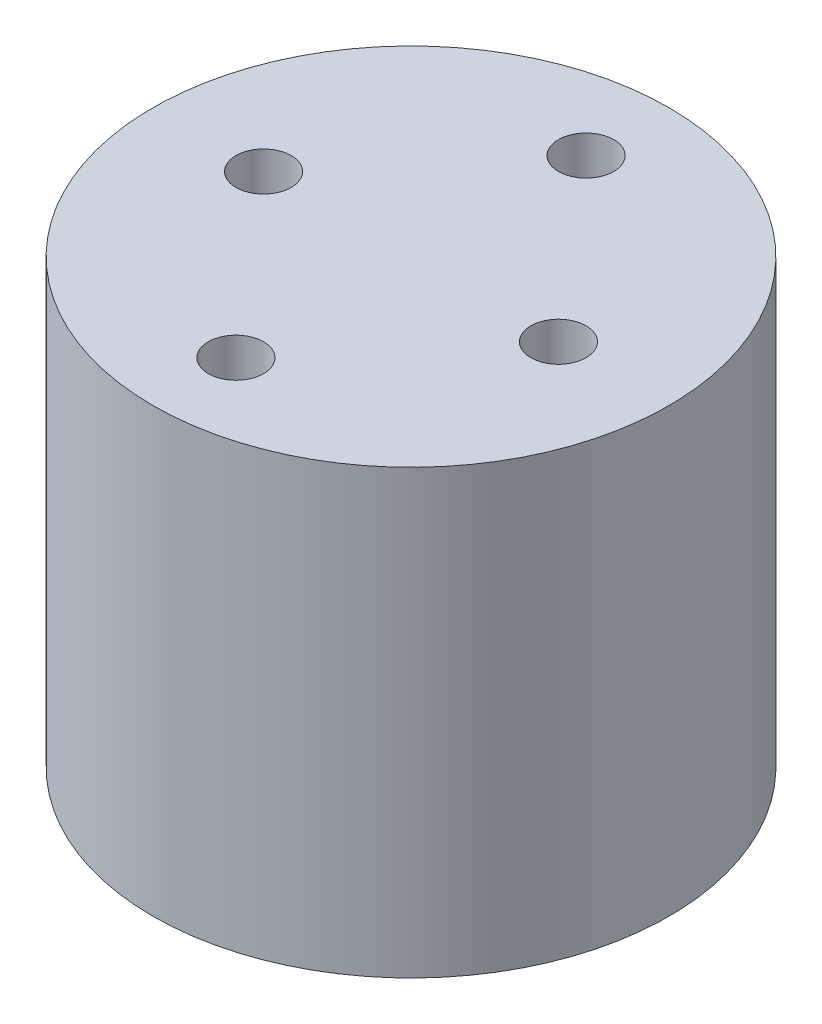
ISO-10303-21;
HEADER;
FILE_DESCRIPTION(('STEP AP214'),'2;1');
FILE_NAME('part.step','',(''),(''),'','','');
FILE_SCHEMA(('AUTOMOTIVE_DESIGN { 1 0 10303 214 1 1 1 1 }'));
ENDSEC;
DATA;
#1=APPLICATION_CONTEXT('core data for automotive mechanical design processes');
#2=APPLICATION_PROTOCOL_DEFINITION('international standard','automotive_design',2000,#1);
#3=PRODUCT_CONTEXT('',#1,'mechanical');
#4=PRODUCT('Part','Part','',(#3));
#5=PRODUCT_RELATED_PRODUCT_CATEGORY('part','',(#4));
#6=PRODUCT_DEFINITION_FORMATION('','',#4);
#7=PRODUCT_DEFINITION_CONTEXT('part definition',#1,'design');
#8=PRODUCT_DEFINITION('design','',#6,#7);
#9=PRODUCT_DEFINITION_SHAPE('','',#8);
#10=(LENGTH_UNIT() NAMED_UNIT(*) SI_UNIT(.MILLI.,.METRE.));
#11=(NAMED_UNIT(*) PLANE_ANGLE_UNIT() SI_UNIT($,.RADIAN.));
#12=(NAMED_UNIT(*) SI_UNIT($,.STERADIAN.) SOLID_ANGLE_UNIT());
#13=UNCERTAINTY_MEASURE_WITH_UNIT(LENGTH_MEASURE(1.E-05),#10,'distance_accuracy_value','');
#14=(GEOMETRIC_REPRESENTATION_CONTEXT(3) GLOBAL_UNCERTAINTY_ASSIGNED_CONTEXT((#13)) GLOBAL_UNIT_ASSIGNED_CONTEXT((#10,
#11,#12)) REPRESENTATION_CONTEXT('',''));
#15=CARTESIAN_POINT('',(0.,0.,0.));
#16=DIRECTION('',(0.,0.,1.));
#17=DIRECTION('',(1.,0.,0.));
#18=AXIS2_PLACEMENT_3D('',#15,#16,#17);
#19=CARTESIAN_POINT('',(0.,24.,0.));
#20=DIRECTION('',(0.,1.,0.));
#21=DIRECTION('',(0.,0.,1.));
#22=AXIS2_PLACEMENT_3D('',#19,#20,#21);
#23=PLANE('',#22);
#24=CARTESIAN_POINT('',(8.,24.,0.));
#25=DIRECTION('',(0.,1.,0.));
#26=DIRECTION('',(0.,0.,1.));
#27=AXIS2_PLACEMENT_3D('',#24,#25,#26);
#28=CIRCLE('',#27,1.5);
#29=CARTESIAN_POINT('',(8.,24.,1.5));
#30=VERTEX_POINT('',#29);
#31=EDGE_CURVE('E59',#30,#30,#28,.F.);
#32=ORIENTED_EDGE('',*,*,#31,.T.);
#33=EDGE_LOOP('',(#32));
#34=FACE_BOUND('',#33,.T.);
#35=CARTESIAN_POINT('',(0.,24.,9.5));
#36=DIRECTION('',(0.,-1.,0.));
#37=DIRECTION('',(0.,0.,-1.));
#38=AXIS2_PLACEMENT_3D('',#35,#36,#37);
#39=CIRCLE('',#38,1.5);
#40=CARTESIAN_POINT('',(0.,24.,8.));
#41=VERTEX_POINT('',#40);
#42=EDGE_CURVE('E79',#41,#41,#39,.T.);
#43=ORIENTED_EDGE('',*,*,#42,.T.);
#44=EDGE_LOOP('',(#43));
#45=FACE_BOUND('',#44,.T.);
#46=CARTESIAN_POINT('',(0.,24.,0.));
#47=DIRECTION('',(0.,1.,0.));
#48=DIRECTION('',(0.,0.,1.));
#49=AXIS2_PLACEMENT_3D('',#46,#47,#48);
#50=CIRCLE('',#49,14.);
#51=CARTESIAN_POINT('',(0.,24.,14.));
#52=VERTEX_POINT('',#51);
#53=EDGE_CURVE('E46',#52,#52,#50,.T.);
#54=ORIENTED_EDGE('',*,*,#53,.T.);
#55=EDGE_LOOP('',(#54));
#56=FACE_BOUND('',#55,.T.);
#57=CARTESIAN_POINT('',(-8.,24.,0.));
#58=DIRECTION('',(0.,1.,0.));
#59=DIRECTION('',(0.,0.,1.));
#60=AXIS2_PLACEMENT_3D('',#57,#58,#59);
#61=CIRCLE('',#60,1.5);
#62=CARTESIAN_POINT('',(-8.,24.,1.5));
#63=VERTEX_POINT('',#62);
#64=EDGE_CURVE('E71',#63,#63,#61,.T.);
#65=ORIENTED_EDGE('',*,*,#64,.F.);
#66=EDGE_LOOP('',(#65));
#67=FACE_BOUND('',#66,.T.);
#68=CARTESIAN_POINT('',(0.,24.,-9.5));
#69=DIRECTION('',(0.,1.,0.));
#70=DIRECTION('',(0.,0.,1.));
#71=AXIS2_PLACEMENT_3D('',#68,#69,#70);
#72=CIRCLE('',#71,1.5);
#73=CARTESIAN_POINT('',(0.,24.,-8.));
#74=VERTEX_POINT('',#73);
#75=EDGE_CURVE('E63',#74,#74,#72,.T.);
#76=ORIENTED_EDGE('',*,*,#75,.F.);
#77=EDGE_LOOP('',(#76));
#78=FACE_BOUND('',#77,.T.);
#79=ADVANCED_FACE('F37',(#34,#45,#56,#67,#78),#23,.T.);
#80=CARTESIAN_POINT('',(0.,24.,0.));
#81=DIRECTION('',(0.,-1.,0.));
#82=DIRECTION('',(0.,0.,-1.));
#83=AXIS2_PLACEMENT_3D('',#80,#81,#82);
#84=CYLINDRICAL_SURFACE('',#83,14.);
#85=ORIENTED_EDGE('',*,*,#53,.F.);
#86=EDGE_LOOP('',(#85));
#87=FACE_BOUND('',#86,.T.);
#88=CARTESIAN_POINT('',(0.,0.,0.));
#89=DIRECTION('',(0.,1.,0.));
#90=DIRECTION('',(0.,0.,1.));
#91=AXIS2_PLACEMENT_3D('',#88,#89,#90);
#92=CIRCLE('',#91,14.);
#93=CARTESIAN_POINT('',(0.,0.,14.));
#94=VERTEX_POINT('',#93);
#95=EDGE_CURVE('E41',#94,#94,#92,.T.);
#96=ORIENTED_EDGE('',*,*,#95,.T.);
#97=EDGE_LOOP('',(#96));
#98=FACE_BOUND('',#97,.T.);
#99=ADVANCED_FACE('F39',(#87,#98),#84,.T.);
#100=CARTESIAN_POINT('',(0.,0.,0.));
#101=DIRECTION('',(0.,1.,0.));
#102=DIRECTION('',(0.,0.,1.));
#103=AXIS2_PLACEMENT_3D('',#100,#101,#102);
#104=PLANE('',#103);
#105=CARTESIAN_POINT('',(0.,0.,0.));
#106=DIRECTION('',(0.,-1.,0.));
#107=DIRECTION('',(0.,0.,-1.));
#108=AXIS2_PLACEMENT_3D('',#105,#106,#107);
#109=CIRCLE('',#108,4.);
#110=CARTESIAN_POINT('',(0.,0.,-4.));
#111=VERTEX_POINT('',#110);
#112=EDGE_CURVE('E10',#111,#111,#109,.T.);
#113=ORIENTED_EDGE('',*,*,#112,.F.);
#114=EDGE_LOOP('',(#113));
#115=FACE_BOUND('',#114,.T.);
#116=ORIENTED_EDGE('',*,*,#95,.F.);
#117=EDGE_LOOP('',(#116));
#118=FACE_BOUND('',#117,.T.);
#119=ADVANCED_FACE('F112',(#115,#118),#104,.F.);
#120=CARTESIAN_POINT('',(0.,21.,9.5));
#121=DIRECTION('',(0.,1.,0.));
#122=DIRECTION('',(0.,0.,1.));
#123=AXIS2_PLACEMENT_3D('',#120,#121,#122);
#124=CYLINDRICAL_SURFACE('',#123,1.5);
#125=CARTESIAN_POINT('',(0.,21.,9.5));
#126=DIRECTION('',(0.,-1.,0.));
#127=DIRECTION('',(0.,0.,-1.));
#128=AXIS2_PLACEMENT_3D('',#125,#126,#127);
#129=CIRCLE('',#128,1.5);
#130=CARTESIAN_POINT('',(0.,21.,8.));
#131=VERTEX_POINT('',#130);
#132=EDGE_CURVE('E83',#131,#131,#129,.T.);
#133=ORIENTED_EDGE('',*,*,#132,.T.);
#134=EDGE_LOOP('',(#133));
#135=FACE_BOUND('',#134,.T.);
#136=ORIENTED_EDGE('',*,*,#42,.F.);
#137=EDGE_LOOP('',(#136));
#138=FACE_BOUND('',#137,.T.);
#139=ADVANCED_FACE('F119',(#135,#138),#124,.F.);
#140=CARTESIAN_POINT('',(0.,21.,9.5));
#141=DIRECTION('',(0.,-1.,0.));
#142=DIRECTION('',(0.,0.,-1.));
#143=AXIS2_PLACEMENT_3D('',#140,#141,#142);
#144=PLANE('',#143);
#145=ORIENTED_EDGE('',*,*,#132,.F.);
#146=EDGE_LOOP('',(#145));
#147=FACE_BOUND('',#146,.T.);
#148=ADVANCED_FACE('F116',(#147),#144,.F.);
#149=CARTESIAN_POINT('',(-8.,21.,0.));
#150=DIRECTION('',(0.,1.,0.));
#151=DIRECTION('',(0.,0.,1.));
#152=AXIS2_PLACEMENT_3D('',#149,#150,#151);
#153=CYLINDRICAL_SURFACE('',#152,1.5);
#154=CARTESIAN_POINT('',(-8.,21.,0.));
#155=DIRECTION('',(0.,1.,0.));
#156=DIRECTION('',(0.,0.,1.));
#157=AXIS2_PLACEMENT_3D('',#154,#155,#156);
#158=CIRCLE('',#157,1.5);
#159=CARTESIAN_POINT('',(-8.,21.,1.5));
#160=VERTEX_POINT('',#159);
#161=EDGE_CURVE('E75',#160,#160,#158,.T.);
#162=ORIENTED_EDGE('',*,*,#161,.F.);
#163=EDGE_LOOP('',(#162));
#164=FACE_BOUND('',#163,.T.);
#165=ORIENTED_EDGE('',*,*,#64,.T.);
#166=EDGE_LOOP('',(#165));
#167=FACE_BOUND('',#166,.T.);
#168=ADVANCED_FACE('F132',(#164,#167),#153,.F.);
#169=CARTESIAN_POINT('',(-8.,21.,0.));
#170=DIRECTION('',(0.,1.,0.));
#171=DIRECTION('',(0.,0.,1.));
#172=AXIS2_PLACEMENT_3D('',#169,#170,#171);
#173=PLANE('',#172);
#174=ORIENTED_EDGE('',*,*,#161,.T.);
#175=EDGE_LOOP('',(#174));
#176=FACE_BOUND('',#175,.T.);
#177=ADVANCED_FACE('F136',(#176),#173,.T.);
#178=CARTESIAN_POINT('',(0.,21.,-9.5));
#179=DIRECTION('',(0.,1.,0.));
#180=DIRECTION('',(0.,0.,1.));
#181=AXIS2_PLACEMENT_3D('',#178,#179,#180);
#182=CYLINDRICAL_SURFACE('',#181,1.5);
#183=CARTESIAN_POINT('',(0.,21.,-9.5));
#184=DIRECTION('',(0.,1.,0.));
#185=DIRECTION('',(0.,0.,1.));
#186=AXIS2_PLACEMENT_3D('',#183,#184,#185);
#187=CIRCLE('',#186,1.5);
#188=CARTESIAN_POINT('',(0.,21.,-8.));
#189=VERTEX_POINT('',#188);
#190=EDGE_CURVE('E67',#189,#189,#187,.T.);
#191=ORIENTED_EDGE('',*,*,#190,.F.);
#192=EDGE_LOOP('',(#191));
#193=FACE_BOUND('',#192,.T.);
#194=ORIENTED_EDGE('',*,*,#75,.T.);
#195=EDGE_LOOP('',(#194));
#196=FACE_BOUND('',#195,.T.);
#197=ADVANCED_FACE('F139',(#193,#196),#182,.F.);
#198=CARTESIAN_POINT('',(0.,21.,0.));
#199=DIRECTION('',(0.,1.,0.));
#200=DIRECTION('',(0.,0.,1.));
#201=AXIS2_PLACEMENT_3D('',#198,#199,#200);
#202=PLANE('',#201);
#203=ORIENTED_EDGE('',*,*,#190,.T.);
#204=EDGE_LOOP('',(#203));
#205=FACE_BOUND('',#204,.T.);
#206=ADVANCED_FACE('F144',(#205),#202,.T.);
#207=CARTESIAN_POINT('',(8.,21.,0.));
#208=DIRECTION('',(0.,1.,0.));
#209=DIRECTION('',(0.,0.,1.));
#210=AXIS2_PLACEMENT_3D('',#207,#208,#209);
#211=CYLINDRICAL_SURFACE('',#210,1.5);
#212=CARTESIAN_POINT('',(8.,21.,0.));
#213=DIRECTION('',(0.,1.,0.));
#214=DIRECTION('',(0.,0.,1.));
#215=AXIS2_PLACEMENT_3D('',#212,#213,#214);
#216=CIRCLE('',#215,1.5);
#217=CARTESIAN_POINT('',(8.,21.,1.5));
#218=VERTEX_POINT('',#217);
#219=EDGE_CURVE('E55',#218,#218,#216,.F.);
#220=ORIENTED_EDGE('',*,*,#219,.T.);
#221=EDGE_LOOP('',(#220));
#222=FACE_BOUND('',#221,.T.);
#223=ORIENTED_EDGE('',*,*,#31,.F.);
#224=EDGE_LOOP('',(#223));
#225=FACE_BOUND('',#224,.T.);
#226=ADVANCED_FACE('F103',(#222,#225),#211,.F.);
#227=CARTESIAN_POINT('',(0.,21.,0.));
#228=DIRECTION('',(0.,1.,0.));
#229=DIRECTION('',(0.,0.,1.));
#230=AXIS2_PLACEMENT_3D('',#227,#228,#229);
#231=PLANE('',#230);
#232=ORIENTED_EDGE('',*,*,#219,.F.);
#233=EDGE_LOOP('',(#232));
#234=FACE_BOUND('',#233,.T.);
#235=ADVANCED_FACE('F96',(#234),#231,.T.);
#236=CARTESIAN_POINT('',(0.,-2.,0.));
#237=DIRECTION('',(0.,1.,0.));
#238=DIRECTION('',(0.,0.,1.));
#239=AXIS2_PLACEMENT_3D('',#236,#237,#238);
#240=CYLINDRICAL_SURFACE('',#239,4.);
#241=CARTESIAN_POINT('',(0.,-2.,0.));
#242=DIRECTION('',(0.,-1.,0.));
#243=DIRECTION('',(0.,0.,-1.));
#244=AXIS2_PLACEMENT_3D('',#241,#242,#243);
#245=CIRCLE('',#244,4.);
#246=CARTESIAN_POINT('',(0.,-2.,-4.));
#247=VERTEX_POINT('',#246);
#248=EDGE_CURVE('E54',#247,#247,#245,.T.);
#249=ORIENTED_EDGE('',*,*,#248,.F.);
#250=EDGE_LOOP('',(#249));
#251=FACE_BOUND('',#250,.T.);
#252=ORIENTED_EDGE('',*,*,#112,.T.);
#253=EDGE_LOOP('',(#252));
#254=FACE_BOUND('',#253,.T.);
#255=ADVANCED_FACE('F94',(#251,#254),#240,.T.);
#256=CARTESIAN_POINT('',(0.,-2.,0.));
#257=DIRECTION('',(0.,-1.,0.));
#258=DIRECTION('',(0.,0.,-1.));
#259=AXIS2_PLACEMENT_3D('',#256,#257,#258);
#260=PLANE('',#259);
#261=ORIENTED_EDGE('',*,*,#248,.T.);
#262=EDGE_LOOP('',(#261));
#263=FACE_BOUND('',#262,.T.);
#264=ADVANCED_FACE('F92',(#263),#260,.T.);
#265=CLOSED_SHELL('',(#79,#99,#119,#139,#148,#168,#177,#197,#206,#226,#235,#255,#264));
#266=MANIFOLD_SOLID_BREP('B2',#265);
#267=ADVANCED_BREP_SHAPE_REPRESENTATION('',(#18,#266),#14);
#268=SHAPE_DEFINITION_REPRESENTATION(#9,#267);
ENDSEC;
END-ISO-10303-21;
